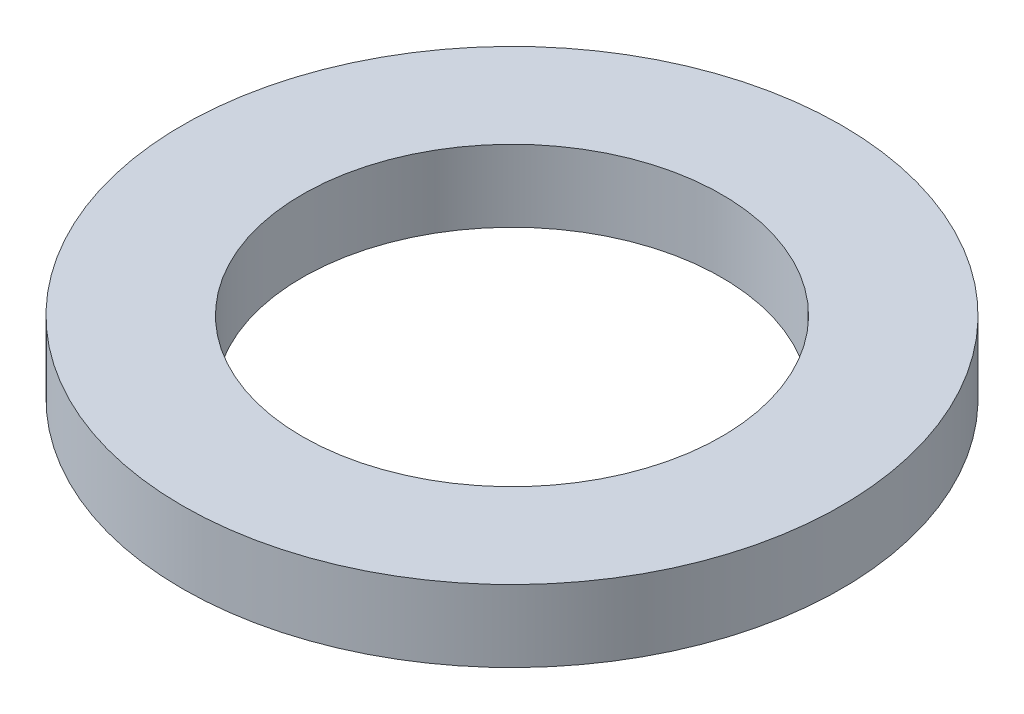
ISO-10303-21;
HEADER;
FILE_DESCRIPTION(('STEP AP214'),'2;1');
FILE_NAME('part.step','',(''),(''),'','','');
FILE_SCHEMA(('AUTOMOTIVE_DESIGN { 1 0 10303 214 1 1 1 1 }'));
ENDSEC;
DATA;
#1=APPLICATION_CONTEXT('core data for automotive mechanical design processes');
#2=APPLICATION_PROTOCOL_DEFINITION('international standard','automotive_design',2000,#1);
#3=PRODUCT_CONTEXT('',#1,'mechanical');
#4=PRODUCT('Part','Part','',(#3));
#5=PRODUCT_RELATED_PRODUCT_CATEGORY('part','',(#4));
#6=PRODUCT_DEFINITION_FORMATION('','',#4);
#7=PRODUCT_DEFINITION_CONTEXT('part definition',#1,'design');
#8=PRODUCT_DEFINITION('design','',#6,#7);
#9=PRODUCT_DEFINITION_SHAPE('','',#8);
#10=(LENGTH_UNIT() NAMED_UNIT(*) SI_UNIT(.MILLI.,.METRE.));
#11=(NAMED_UNIT(*) PLANE_ANGLE_UNIT() SI_UNIT($,.RADIAN.));
#12=(NAMED_UNIT(*) SI_UNIT($,.STERADIAN.) SOLID_ANGLE_UNIT());
#13=UNCERTAINTY_MEASURE_WITH_UNIT(LENGTH_MEASURE(1.E-05),#10,'distance_accuracy_value','');
#14=(GEOMETRIC_REPRESENTATION_CONTEXT(3) GLOBAL_UNCERTAINTY_ASSIGNED_CONTEXT((#13)) GLOBAL_UNIT_ASSIGNED_CONTEXT((#10,
#11,#12)) REPRESENTATION_CONTEXT('',''));
#15=CARTESIAN_POINT('',(0.,0.,0.));
#16=DIRECTION('',(0.,0.,1.));
#17=DIRECTION('',(1.,0.,0.));
#18=AXIS2_PLACEMENT_3D('',#15,#16,#17);
#19=CARTESIAN_POINT('',(0.,6.,0.));
#20=DIRECTION('',(0.,-1.,0.));
#21=DIRECTION('',(0.,0.,-1.));
#22=AXIS2_PLACEMENT_3D('',#19,#20,#21);
#23=CYLINDRICAL_SURFACE('',#22,27.5);
#24=CARTESIAN_POINT('',(0.,6.,0.));
#25=DIRECTION('',(0.,1.,0.));
#26=DIRECTION('',(0.,0.,1.));
#27=AXIS2_PLACEMENT_3D('',#24,#25,#26);
#28=CIRCLE('',#27,27.5);
#29=CARTESIAN_POINT('',(0.,6.,27.5));
#30=VERTEX_POINT('',#29);
#31=EDGE_CURVE('E10',#30,#30,#28,.T.);
#32=ORIENTED_EDGE('',*,*,#31,.F.);
#33=EDGE_LOOP('',(#32));
#34=FACE_BOUND('',#33,.T.);
#35=CARTESIAN_POINT('',(0.,0.,0.));
#36=DIRECTION('',(0.,1.,0.));
#37=DIRECTION('',(0.,0.,1.));
#38=AXIS2_PLACEMENT_3D('',#35,#36,#37);
#39=CIRCLE('',#38,27.5);
#40=CARTESIAN_POINT('',(0.,0.,27.5));
#41=VERTEX_POINT('',#40);
#42=EDGE_CURVE('E37',#41,#41,#39,.T.);
#43=ORIENTED_EDGE('',*,*,#42,.T.);
#44=EDGE_LOOP('',(#43));
#45=FACE_BOUND('',#44,.T.);
#46=ADVANCED_FACE('F40',(#34,#45),#23,.T.);
#47=CARTESIAN_POINT('',(0.,6.,0.));
#48=DIRECTION('',(0.,1.,0.));
#49=DIRECTION('',(0.,0.,1.));
#50=AXIS2_PLACEMENT_3D('',#47,#48,#49);
#51=PLANE('',#50);
#52=CARTESIAN_POINT('',(0.,6.,0.));
#53=DIRECTION('',(0.,1.,0.));
#54=DIRECTION('',(0.,0.,1.));
#55=AXIS2_PLACEMENT_3D('',#52,#53,#54);
#56=CIRCLE('',#55,17.5);
#57=CARTESIAN_POINT('',(0.,6.,17.5));
#58=VERTEX_POINT('',#57);
#59=EDGE_CURVE('E50',#58,#58,#56,.T.);
#60=ORIENTED_EDGE('',*,*,#59,.F.);
#61=EDGE_LOOP('',(#60));
#62=FACE_BOUND('',#61,.T.);
#63=ORIENTED_EDGE('',*,*,#31,.T.);
#64=EDGE_LOOP('',(#63));
#65=FACE_BOUND('',#64,.T.);
#66=ADVANCED_FACE('F59',(#62,#65),#51,.T.);
#67=CARTESIAN_POINT('',(0.,0.,0.));
#68=DIRECTION('',(0.,1.,0.));
#69=DIRECTION('',(0.,0.,1.));
#70=AXIS2_PLACEMENT_3D('',#67,#68,#69);
#71=PLANE('',#70);
#72=CARTESIAN_POINT('',(0.,0.,0.));
#73=DIRECTION('',(0.,1.,0.));
#74=DIRECTION('',(0.,0.,1.));
#75=AXIS2_PLACEMENT_3D('',#72,#73,#74);
#76=CIRCLE('',#75,17.5);
#77=CARTESIAN_POINT('',(0.,0.,17.5));
#78=VERTEX_POINT('',#77);
#79=EDGE_CURVE('E47',#78,#78,#76,.T.);
#80=ORIENTED_EDGE('',*,*,#79,.T.);
#81=EDGE_LOOP('',(#80));
#82=FACE_BOUND('',#81,.T.);
#83=ORIENTED_EDGE('',*,*,#42,.F.);
#84=EDGE_LOOP('',(#83));
#85=FACE_BOUND('',#84,.T.);
#86=ADVANCED_FACE('F58',(#82,#85),#71,.F.);
#87=CARTESIAN_POINT('',(0.,6.,0.));
#88=DIRECTION('',(0.,-1.,0.));
#89=DIRECTION('',(0.,0.,-1.));
#90=AXIS2_PLACEMENT_3D('',#87,#88,#89);
#91=CYLINDRICAL_SURFACE('',#90,17.5);
#92=ORIENTED_EDGE('',*,*,#59,.T.);
#93=EDGE_LOOP('',(#92));
#94=FACE_BOUND('',#93,.T.);
#95=ORIENTED_EDGE('',*,*,#79,.F.);
#96=EDGE_LOOP('',(#95));
#97=FACE_BOUND('',#96,.T.);
#98=ADVANCED_FACE('F54',(#94,#97),#91,.F.);
#99=CLOSED_SHELL('',(#46,#66,#86,#98));
#100=MANIFOLD_SOLID_BREP('B2',#99);
#101=ADVANCED_BREP_SHAPE_REPRESENTATION('',(#18,#100),#14);
#102=SHAPE_DEFINITION_REPRESENTATION(#9,#101);
ENDSEC;
END-ISO-10303-21;
